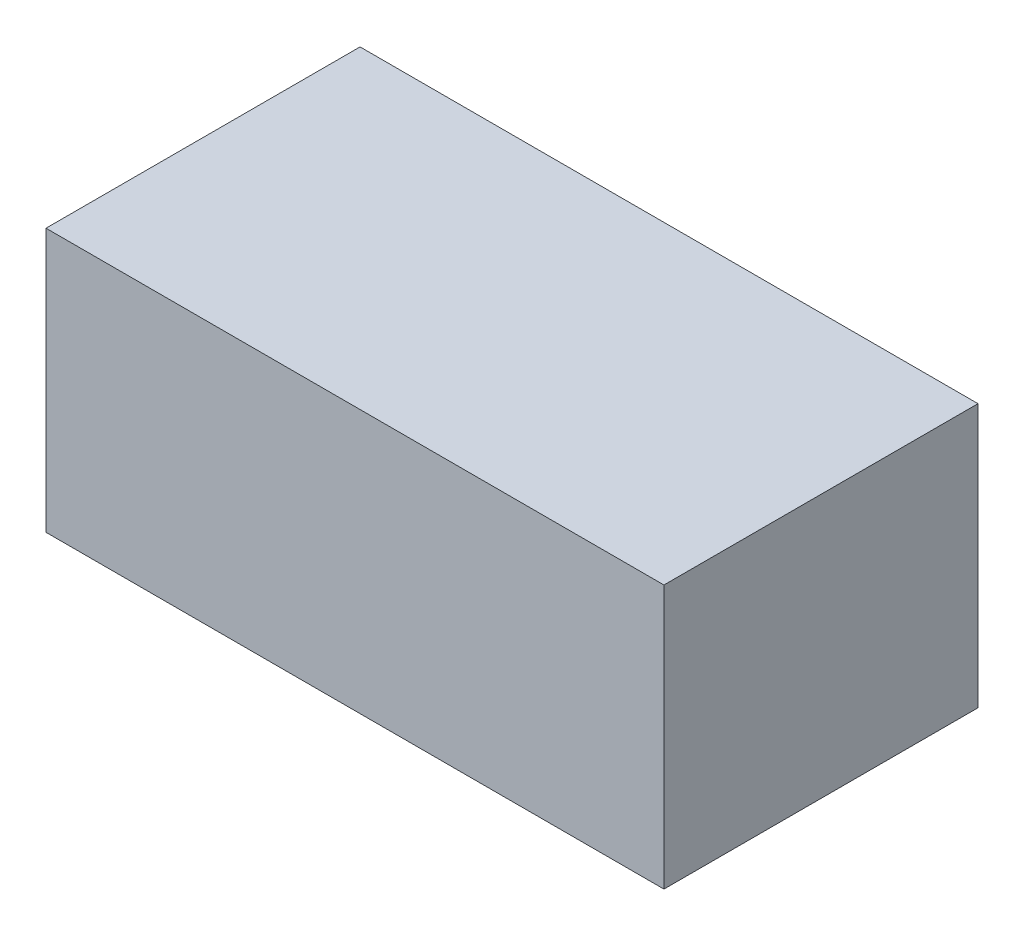
ISO-10303-21;
HEADER;
FILE_DESCRIPTION(('STEP AP214'),'2;1');
FILE_NAME('part.step','',(''),(''),'','','');
FILE_SCHEMA(('AUTOMOTIVE_DESIGN { 1 0 10303 214 1 1 1 1 }'));
ENDSEC;
DATA;
#1=APPLICATION_CONTEXT('core data for automotive mechanical design processes');
#2=APPLICATION_PROTOCOL_DEFINITION('international standard','automotive_design',2000,#1);
#3=PRODUCT_CONTEXT('',#1,'mechanical');
#4=PRODUCT('Part','Part','',(#3));
#5=PRODUCT_RELATED_PRODUCT_CATEGORY('part','',(#4));
#6=PRODUCT_DEFINITION_FORMATION('','',#4);
#7=PRODUCT_DEFINITION_CONTEXT('part definition',#1,'design');
#8=PRODUCT_DEFINITION('design','',#6,#7);
#9=PRODUCT_DEFINITION_SHAPE('','',#8);
#10=(LENGTH_UNIT() NAMED_UNIT(*) SI_UNIT(.MILLI.,.METRE.));
#11=(NAMED_UNIT(*) PLANE_ANGLE_UNIT() SI_UNIT($,.RADIAN.));
#12=(NAMED_UNIT(*) SI_UNIT($,.STERADIAN.) SOLID_ANGLE_UNIT());
#13=UNCERTAINTY_MEASURE_WITH_UNIT(LENGTH_MEASURE(1.E-05),#10,'distance_accuracy_value','');
#14=(GEOMETRIC_REPRESENTATION_CONTEXT(3) GLOBAL_UNCERTAINTY_ASSIGNED_CONTEXT((#13)) GLOBAL_UNIT_ASSIGNED_CONTEXT((#10,
#11,#12)) REPRESENTATION_CONTEXT('',''));
#15=CARTESIAN_POINT('',(0.,0.,0.));
#16=DIRECTION('',(0.,0.,1.));
#17=DIRECTION('',(1.,0.,0.));
#18=AXIS2_PLACEMENT_3D('',#15,#16,#17);
#19=CARTESIAN_POINT('',(0.,130.,0.));
#20=DIRECTION('',(1.,0.,0.));
#21=DIRECTION('',(0.,0.,-1.));
#22=AXIS2_PLACEMENT_3D('',#19,#20,#21);
#23=PLANE('',#22);
#24=DIRECTION('',(0.,0.,1.));
#25=VECTOR('',#24,1.);
#26=CARTESIAN_POINT('',(0.,0.,0.));
#27=LINE('',#26,#25);
#28=CARTESIAN_POINT('',(0.,0.,-155.));
#29=VERTEX_POINT('',#28);
#30=CARTESIAN_POINT('',(0.,0.,0.));
#31=VERTEX_POINT('',#30);
#32=EDGE_CURVE('E107',#29,#31,#27,.T.);
#33=ORIENTED_EDGE('',*,*,#32,.T.);
#34=DIRECTION('',(0.,-1.,0.));
#35=VECTOR('',#34,1.);
#36=CARTESIAN_POINT('',(0.,130.,0.));
#37=LINE('',#36,#35);
#38=CARTESIAN_POINT('',(0.,130.,0.));
#39=VERTEX_POINT('',#38);
#40=EDGE_CURVE('E11',#39,#31,#37,.T.);
#41=ORIENTED_EDGE('',*,*,#40,.F.);
#42=DIRECTION('',(0.,0.,1.));
#43=VECTOR('',#42,1.);
#44=CARTESIAN_POINT('',(0.,130.,0.));
#45=LINE('',#44,#43);
#46=CARTESIAN_POINT('',(0.,130.,-155.));
#47=VERTEX_POINT('',#46);
#48=EDGE_CURVE('E91',#47,#39,#45,.T.);
#49=ORIENTED_EDGE('',*,*,#48,.F.);
#50=DIRECTION('',(0.,-1.,0.));
#51=VECTOR('',#50,1.);
#52=CARTESIAN_POINT('',(0.,130.,-155.));
#53=LINE('',#52,#51);
#54=EDGE_CURVE('E103',#47,#29,#53,.T.);
#55=ORIENTED_EDGE('',*,*,#54,.T.);
#56=EDGE_LOOP('',(#33,#41,#49,#55));
#57=FACE_BOUND('',#56,.T.);
#58=ADVANCED_FACE('F39',(#57),#23,.F.);
#59=CARTESIAN_POINT('',(0.,130.,0.));
#60=DIRECTION('',(0.,0.,-1.));
#61=DIRECTION('',(-1.,0.,0.));
#62=AXIS2_PLACEMENT_3D('',#59,#60,#61);
#63=PLANE('',#62);
#64=DIRECTION('',(1.,0.,0.));
#65=VECTOR('',#64,1.);
#66=CARTESIAN_POINT('',(0.,0.,0.));
#67=LINE('',#66,#65);
#68=CARTESIAN_POINT('',(305.,0.,0.));
#69=VERTEX_POINT('',#68);
#70=EDGE_CURVE('E96',#31,#69,#67,.T.);
#71=ORIENTED_EDGE('',*,*,#70,.T.);
#72=DIRECTION('',(0.,-1.,0.));
#73=VECTOR('',#72,1.);
#74=CARTESIAN_POINT('',(305.,130.,0.));
#75=LINE('',#74,#73);
#76=CARTESIAN_POINT('',(305.,130.,0.));
#77=VERTEX_POINT('',#76);
#78=EDGE_CURVE('E48',#77,#69,#75,.T.);
#79=ORIENTED_EDGE('',*,*,#78,.F.);
#80=DIRECTION('',(1.,0.,0.));
#81=VECTOR('',#80,1.);
#82=CARTESIAN_POINT('',(0.,130.,0.));
#83=LINE('',#82,#81);
#84=EDGE_CURVE('E86',#39,#77,#83,.T.);
#85=ORIENTED_EDGE('',*,*,#84,.F.);
#86=ORIENTED_EDGE('',*,*,#40,.T.);
#87=EDGE_LOOP('',(#71,#79,#85,#86));
#88=FACE_BOUND('',#87,.T.);
#89=ADVANCED_FACE('F95',(#88),#63,.F.);
#90=CARTESIAN_POINT('',(305.,130.,0.));
#91=DIRECTION('',(-1.,0.,0.));
#92=DIRECTION('',(0.,0.,1.));
#93=AXIS2_PLACEMENT_3D('',#90,#91,#92);
#94=PLANE('',#93);
#95=DIRECTION('',(0.,0.,-1.));
#96=VECTOR('',#95,1.);
#97=CARTESIAN_POINT('',(305.,0.,0.));
#98=LINE('',#97,#96);
#99=CARTESIAN_POINT('',(305.,0.,-155.));
#100=VERTEX_POINT('',#99);
#101=EDGE_CURVE('E73',#69,#100,#98,.T.);
#102=ORIENTED_EDGE('',*,*,#101,.T.);
#103=DIRECTION('',(0.,-1.,0.));
#104=VECTOR('',#103,1.);
#105=CARTESIAN_POINT('',(305.,130.,-155.));
#106=LINE('',#105,#104);
#107=CARTESIAN_POINT('',(305.,130.,-155.));
#108=VERTEX_POINT('',#107);
#109=EDGE_CURVE('E98',#108,#100,#106,.T.);
#110=ORIENTED_EDGE('',*,*,#109,.F.);
#111=DIRECTION('',(0.,0.,-1.));
#112=VECTOR('',#111,1.);
#113=CARTESIAN_POINT('',(305.,130.,0.));
#114=LINE('',#113,#112);
#115=EDGE_CURVE('E89',#77,#108,#114,.T.);
#116=ORIENTED_EDGE('',*,*,#115,.F.);
#117=ORIENTED_EDGE('',*,*,#78,.T.);
#118=EDGE_LOOP('',(#102,#110,#116,#117));
#119=FACE_BOUND('',#118,.T.);
#120=ADVANCED_FACE('F99',(#119),#94,.F.);
#121=CARTESIAN_POINT('',(0.,130.,-155.));
#122=DIRECTION('',(0.,0.,1.));
#123=DIRECTION('',(1.,0.,0.));
#124=AXIS2_PLACEMENT_3D('',#121,#122,#123);
#125=PLANE('',#124);
#126=DIRECTION('',(-1.,0.,0.));
#127=VECTOR('',#126,1.);
#128=CARTESIAN_POINT('',(0.,0.,-155.));
#129=LINE('',#128,#127);
#130=EDGE_CURVE('E79',#100,#29,#129,.T.);
#131=ORIENTED_EDGE('',*,*,#130,.T.);
#132=ORIENTED_EDGE('',*,*,#54,.F.);
#133=DIRECTION('',(-1.,0.,0.));
#134=VECTOR('',#133,1.);
#135=CARTESIAN_POINT('',(0.,130.,-155.));
#136=LINE('',#135,#134);
#137=EDGE_CURVE('E56',#108,#47,#136,.T.);
#138=ORIENTED_EDGE('',*,*,#137,.F.);
#139=ORIENTED_EDGE('',*,*,#109,.T.);
#140=EDGE_LOOP('',(#131,#132,#138,#139));
#141=FACE_BOUND('',#140,.T.);
#142=ADVANCED_FACE('F120',(#141),#125,.F.);
#143=CARTESIAN_POINT('',(0.,130.,0.));
#144=DIRECTION('',(0.,-1.,0.));
#145=DIRECTION('',(0.,0.,-1.));
#146=AXIS2_PLACEMENT_3D('',#143,#144,#145);
#147=PLANE('',#146);
#148=ORIENTED_EDGE('',*,*,#48,.T.);
#149=ORIENTED_EDGE('',*,*,#84,.T.);
#150=ORIENTED_EDGE('',*,*,#115,.T.);
#151=ORIENTED_EDGE('',*,*,#137,.T.);
#152=EDGE_LOOP('',(#148,#149,#150,#151));
#153=FACE_BOUND('',#152,.T.);
#154=ADVANCED_FACE('F87',(#153),#147,.F.);
#155=CARTESIAN_POINT('',(0.,0.,0.));
#156=DIRECTION('',(0.,-1.,0.));
#157=DIRECTION('',(0.,0.,-1.));
#158=AXIS2_PLACEMENT_3D('',#155,#156,#157);
#159=PLANE('',#158);
#160=ORIENTED_EDGE('',*,*,#32,.F.);
#161=ORIENTED_EDGE('',*,*,#130,.F.);
#162=ORIENTED_EDGE('',*,*,#101,.F.);
#163=ORIENTED_EDGE('',*,*,#70,.F.);
#164=EDGE_LOOP('',(#160,#161,#162,#163));
#165=FACE_BOUND('',#164,.T.);
#166=ADVANCED_FACE('F123',(#165),#159,.T.);
#167=CLOSED_SHELL('',(#58,#89,#120,#142,#154,#166));
#168=MANIFOLD_SOLID_BREP('B2',#167);
#169=ADVANCED_BREP_SHAPE_REPRESENTATION('',(#18,#168),#14);
#170=SHAPE_DEFINITION_REPRESENTATION(#9,#169);
ENDSEC;
END-ISO-10303-21;
